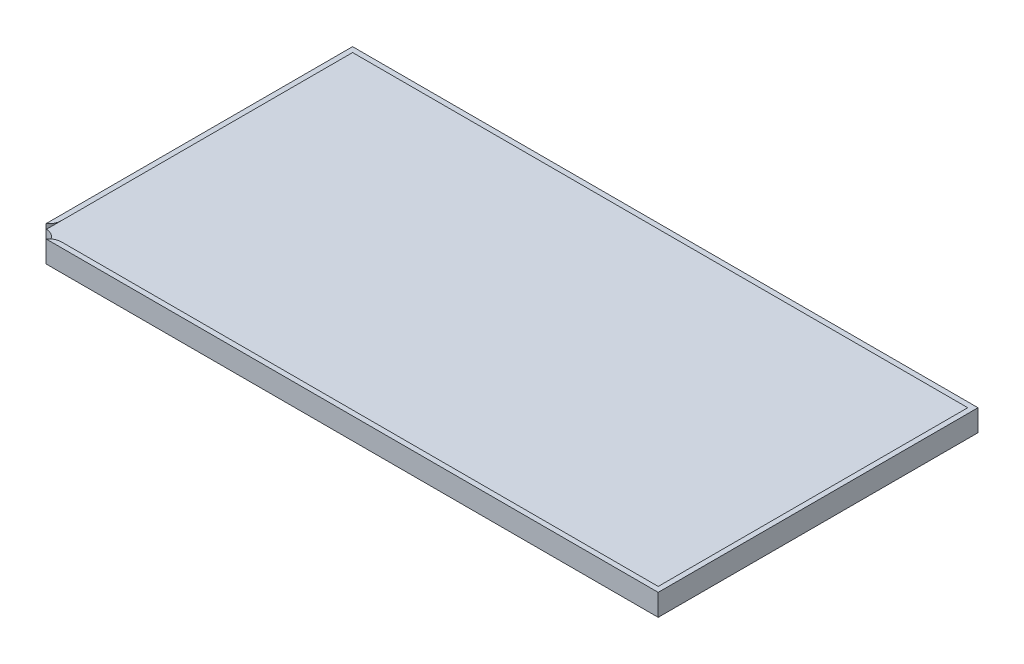
ISO-10303-21;
HEADER;
FILE_DESCRIPTION(('STEP AP214'),'2;1');
FILE_NAME('part.step','',(''),(''),'','','');
FILE_SCHEMA(('AUTOMOTIVE_DESIGN { 1 0 10303 214 1 1 1 1 }'));
ENDSEC;
DATA;
#1=APPLICATION_CONTEXT('core data for automotive mechanical design processes');
#2=APPLICATION_PROTOCOL_DEFINITION('international standard','automotive_design',2000,#1);
#3=PRODUCT_CONTEXT('',#1,'mechanical');
#4=PRODUCT('Part','Part','',(#3));
#5=PRODUCT_RELATED_PRODUCT_CATEGORY('part','',(#4));
#6=PRODUCT_DEFINITION_FORMATION('','',#4);
#7=PRODUCT_DEFINITION_CONTEXT('part definition',#1,'design');
#8=PRODUCT_DEFINITION('design','',#6,#7);
#9=PRODUCT_DEFINITION_SHAPE('','',#8);
#10=(LENGTH_UNIT() NAMED_UNIT(*) SI_UNIT(.MILLI.,.METRE.));
#11=(NAMED_UNIT(*) PLANE_ANGLE_UNIT() SI_UNIT($,.RADIAN.));
#12=(NAMED_UNIT(*) SI_UNIT($,.STERADIAN.) SOLID_ANGLE_UNIT());
#13=UNCERTAINTY_MEASURE_WITH_UNIT(LENGTH_MEASURE(1.E-05),#10,'distance_accuracy_value','');
#14=(GEOMETRIC_REPRESENTATION_CONTEXT(3) GLOBAL_UNCERTAINTY_ASSIGNED_CONTEXT((#13)) GLOBAL_UNIT_ASSIGNED_CONTEXT((#10,
#11,#12)) REPRESENTATION_CONTEXT('',''));
#15=CARTESIAN_POINT('',(0.,0.,0.));
#16=DIRECTION('',(0.,0.,1.));
#17=DIRECTION('',(1.,0.,0.));
#18=AXIS2_PLACEMENT_3D('',#15,#16,#17);
#19=CARTESIAN_POINT('',(0.,27.,0.));
#20=DIRECTION('',(0.,-1.,0.));
#21=DIRECTION('',(0.,0.,-1.));
#22=AXIS2_PLACEMENT_3D('',#19,#20,#21);
#23=PLANE('',#22);
#24=CARTESIAN_POINT('',(-1878.7,27.,799.));
#25=DIRECTION('',(0.,1.,0.));
#26=DIRECTION('',(0.,0.,1.));
#27=AXIS2_PLACEMENT_3D('',#24,#25,#26);
#28=CIRCLE('',#27,76.2);
#29=CARTESIAN_POINT('',(-1832.5,27.,859.597029630171));
#30=VERTEX_POINT('',#29);
#31=CARTESIAN_POINT('',(-1802.5,27.,799.));
#32=VERTEX_POINT('',#31);
#33=EDGE_CURVE('E215',#30,#32,#28,.T.);
#34=ORIENTED_EDGE('',*,*,#33,.T.);
#35=DIRECTION('',(0.,0.,1.));
#36=VECTOR('',#35,1.);
#37=CARTESIAN_POINT('',(-1802.5,27.,0.));
#38=LINE('',#37,#36);
#39=CARTESIAN_POINT('',(-1802.5,27.,-907.));
#40=VERTEX_POINT('',#39);
#41=EDGE_CURVE('E42',#32,#40,#38,.F.);
#42=ORIENTED_EDGE('',*,*,#41,.T.);
#43=DIRECTION('',(-1.,0.,0.));
#44=VECTOR('',#43,1.);
#45=CARTESIAN_POINT('',(0.,27.,-907.));
#46=LINE('',#45,#44);
#47=CARTESIAN_POINT('',(1802.5,27.,-907.000000000001));
#48=VERTEX_POINT('',#47);
#49=EDGE_CURVE('E195',#40,#48,#46,.F.);
#50=ORIENTED_EDGE('',*,*,#49,.T.);
#51=DIRECTION('',(0.,0.,-1.));
#52=VECTOR('',#51,1.);
#53=CARTESIAN_POINT('',(1802.5,27.,0.));
#54=LINE('',#53,#52);
#55=CARTESIAN_POINT('',(1802.5,27.,907.));
#56=VERTEX_POINT('',#55);
#57=EDGE_CURVE('E193',#48,#56,#54,.F.);
#58=ORIENTED_EDGE('',*,*,#57,.T.);
#59=DIRECTION('',(1.,0.,0.));
#60=VECTOR('',#59,1.);
#61=CARTESIAN_POINT('',(0.,27.,907.));
#62=LINE('',#61,#60);
#63=CARTESIAN_POINT('',(-1694.5,27.,907.));
#64=VERTEX_POINT('',#63);
#65=EDGE_CURVE('E11',#56,#64,#62,.F.);
#66=ORIENTED_EDGE('',*,*,#65,.T.);
#67=CARTESIAN_POINT('',(-1694.5,27.,983.2));
#68=DIRECTION('',(0.,1.,0.));
#69=DIRECTION('',(0.,0.,1.));
#70=AXIS2_PLACEMENT_3D('',#67,#68,#69);
#71=CIRCLE('',#70,76.2);
#72=CARTESIAN_POINT('',(-1755.09702963017,27.,937.));
#73=VERTEX_POINT('',#72);
#74=EDGE_CURVE('E147',#64,#73,#71,.T.);
#75=ORIENTED_EDGE('',*,*,#74,.T.);
#76=DIRECTION('',(1.,0.,0.));
#77=VECTOR('',#76,1.);
#78=CARTESIAN_POINT('',(-1832.5,27.,937.));
#79=LINE('',#78,#77);
#80=CARTESIAN_POINT('',(1832.5,27.,937.));
#81=VERTEX_POINT('',#80);
#82=EDGE_CURVE('E143',#73,#81,#79,.T.);
#83=ORIENTED_EDGE('',*,*,#82,.T.);
#84=DIRECTION('',(0.,0.,-1.));
#85=VECTOR('',#84,1.);
#86=CARTESIAN_POINT('',(1832.5,27.,937.));
#87=LINE('',#86,#85);
#88=CARTESIAN_POINT('',(1832.5,27.,-937.));
#89=VERTEX_POINT('',#88);
#90=EDGE_CURVE('E167',#81,#89,#87,.T.);
#91=ORIENTED_EDGE('',*,*,#90,.T.);
#92=DIRECTION('',(-1.,0.,0.));
#93=VECTOR('',#92,1.);
#94=CARTESIAN_POINT('',(-1832.5,27.,-937.));
#95=LINE('',#94,#93);
#96=CARTESIAN_POINT('',(-1832.5,27.,-937.));
#97=VERTEX_POINT('',#96);
#98=EDGE_CURVE('E170',#89,#97,#95,.T.);
#99=ORIENTED_EDGE('',*,*,#98,.T.);
#100=DIRECTION('',(0.,0.,1.));
#101=VECTOR('',#100,1.);
#102=CARTESIAN_POINT('',(-1832.5,27.,937.));
#103=LINE('',#102,#101);
#104=EDGE_CURVE('E172',#97,#30,#103,.T.);
#105=ORIENTED_EDGE('',*,*,#104,.T.);
#106=EDGE_LOOP('',(#34,#42,#50,#58,#66,#75,#83,#91,#99,#105));
#107=FACE_BOUND('',#106,.T.);
#108=ADVANCED_FACE('F33',(#107),#23,.F.);
#109=CARTESIAN_POINT('',(-1832.5,27.,937.));
#110=DIRECTION('',(1.,0.,0.));
#111=DIRECTION('',(0.,0.,-1.));
#112=AXIS2_PLACEMENT_3D('',#109,#110,#111);
#113=PLANE('',#112);
#114=DIRECTION('',(0.,0.,-1.));
#115=VECTOR('',#114,1.);
#116=CARTESIAN_POINT('',(-1832.5,-100.,-937.));
#117=LINE('',#116,#115);
#118=CARTESIAN_POINT('',(-1832.5,-100.,859.597029630172));
#119=VERTEX_POINT('',#118);
#120=CARTESIAN_POINT('',(-1832.5,-100.,-937.));
#121=VERTEX_POINT('',#120);
#122=EDGE_CURVE('E161',#119,#121,#117,.T.);
#123=ORIENTED_EDGE('',*,*,#122,.F.);
#124=DIRECTION('',(0.,1.,0.));
#125=VECTOR('',#124,1.);
#126=CARTESIAN_POINT('',(-1832.5,-100.001,859.597029630172));
#127=LINE('',#126,#125);
#128=CARTESIAN_POINT('',(-1832.5,0.,859.597029630172));
#129=VERTEX_POINT('',#128);
#130=EDGE_CURVE('E50',#129,#119,#127,.F.);
#131=ORIENTED_EDGE('',*,*,#130,.F.);
#132=DIRECTION('',(0.,1.,0.));
#133=VECTOR('',#132,1.);
#134=CARTESIAN_POINT('',(-1832.5,-195.161471607487,859.597029630171));
#135=LINE('',#134,#133);
#136=EDGE_CURVE('E144',#129,#30,#135,.T.);
#137=ORIENTED_EDGE('',*,*,#136,.T.);
#138=ORIENTED_EDGE('',*,*,#104,.F.);
#139=DIRECTION('',(0.,-1.,0.));
#140=VECTOR('',#139,1.);
#141=CARTESIAN_POINT('',(-1832.5,27.,-937.));
#142=LINE('',#141,#140);
#143=EDGE_CURVE('E178',#97,#121,#142,.T.);
#144=ORIENTED_EDGE('',*,*,#143,.T.);
#145=EDGE_LOOP('',(#123,#131,#137,#138,#144));
#146=FACE_BOUND('',#145,.T.);
#147=ADVANCED_FACE('F237',(#146),#113,.F.);
#148=CARTESIAN_POINT('',(-1832.5,27.,937.));
#149=DIRECTION('',(0.,0.,-1.));
#150=DIRECTION('',(-1.,0.,0.));
#151=AXIS2_PLACEMENT_3D('',#148,#149,#150);
#152=PLANE('',#151);
#153=DIRECTION('',(0.,1.,0.));
#154=VECTOR('',#153,1.);
#155=CARTESIAN_POINT('',(-1755.09702963017,-195.161471607487,937.));
#156=LINE('',#155,#154);
#157=CARTESIAN_POINT('',(-1755.09702963017,0.,937.));
#158=VERTEX_POINT('',#157);
#159=EDGE_CURVE('E134',#158,#73,#156,.T.);
#160=ORIENTED_EDGE('',*,*,#159,.F.);
#161=DIRECTION('',(0.,1.,0.));
#162=VECTOR('',#161,1.);
#163=CARTESIAN_POINT('',(-1755.09702963017,-100.001,937.));
#164=LINE('',#163,#162);
#165=CARTESIAN_POINT('',(-1755.09702963017,-100.,937.));
#166=VERTEX_POINT('',#165);
#167=EDGE_CURVE('E117',#166,#158,#164,.T.);
#168=ORIENTED_EDGE('',*,*,#167,.F.);
#169=DIRECTION('',(-1.,0.,0.));
#170=VECTOR('',#169,1.);
#171=CARTESIAN_POINT('',(-1832.5,-100.,937.));
#172=LINE('',#171,#170);
#173=CARTESIAN_POINT('',(1832.5,-100.,937.));
#174=VERTEX_POINT('',#173);
#175=EDGE_CURVE('E159',#174,#166,#172,.T.);
#176=ORIENTED_EDGE('',*,*,#175,.F.);
#177=DIRECTION('',(0.,-1.,0.));
#178=VECTOR('',#177,1.);
#179=CARTESIAN_POINT('',(1832.5,27.,937.));
#180=LINE('',#179,#178);
#181=EDGE_CURVE('E176',#81,#174,#180,.T.);
#182=ORIENTED_EDGE('',*,*,#181,.F.);
#183=ORIENTED_EDGE('',*,*,#82,.F.);
#184=EDGE_LOOP('',(#160,#168,#176,#182,#183));
#185=FACE_BOUND('',#184,.T.);
#186=ADVANCED_FACE('F141',(#185),#152,.F.);
#187=CARTESIAN_POINT('',(-1829.5,0.,0.));
#188=DIRECTION('',(-0.707106781186544,0.707106781186551,0.));
#189=DIRECTION('',(0.,0.,1.));
#190=AXIS2_PLACEMENT_3D('',#187,#188,#189);
#191=PLANE('',#190);
#192=ORIENTED_EDGE('',*,*,#41,.F.);
#193=CARTESIAN_POINT('',(-1878.7,-49.1999999999992,799.));
#194=DIRECTION('',(-0.707106781186544,0.707106781186551,0.));
#195=DIRECTION('',(0.707106781186551,0.707106781186544,0.));
#196=AXIS2_PLACEMENT_3D('',#193,#194,#195);
#197=ELLIPSE('',#196,107.763073452829,76.2);
#198=CARTESIAN_POINT('',(-1829.5,0.,857.18762755088));
#199=VERTEX_POINT('',#198);
#200=EDGE_CURVE('E153',#32,#199,#197,.F.);
#201=ORIENTED_EDGE('',*,*,#200,.T.);
#202=DIRECTION('',(0.,0.,1.));
#203=VECTOR('',#202,1.);
#204=CARTESIAN_POINT('',(-1829.5,0.,0.));
#205=LINE('',#204,#203);
#206=CARTESIAN_POINT('',(-1829.5,0.,-934.000000000001));
#207=VERTEX_POINT('',#206);
#208=EDGE_CURVE('E189',#207,#199,#205,.T.);
#209=ORIENTED_EDGE('',*,*,#208,.F.);
#210=DIRECTION('',(0.577350269189628,0.577350269189621,0.577350269189628));
#211=VECTOR('',#210,1.);
#212=CARTESIAN_POINT('',(-1219.66666666666,609.833333333331,-324.166666666663));
#213=LINE('',#212,#211);
#214=EDGE_CURVE('E37',#207,#40,#213,.T.);
#215=ORIENTED_EDGE('',*,*,#214,.T.);
#216=EDGE_LOOP('',(#192,#201,#209,#215));
#217=FACE_BOUND('',#216,.T.);
#218=ADVANCED_FACE('F209',(#217),#191,.F.);
#219=CARTESIAN_POINT('',(0.,0.,934.000000000001));
#220=DIRECTION('',(0.,0.707106781186551,0.707106781186544));
#221=DIRECTION('',(1.,0.,0.));
#222=AXIS2_PLACEMENT_3D('',#219,#220,#221);
#223=PLANE('',#222);
#224=DIRECTION('',(1.,0.,0.));
#225=VECTOR('',#224,1.);
#226=CARTESIAN_POINT('',(0.,0.,934.000000000001));
#227=LINE('',#226,#225);
#228=CARTESIAN_POINT('',(-1752.68762755088,0.,934.000000000001));
#229=VERTEX_POINT('',#228);
#230=CARTESIAN_POINT('',(1829.5,0.,934.000000000001));
#231=VERTEX_POINT('',#230);
#232=EDGE_CURVE('E191',#229,#231,#227,.T.);
#233=ORIENTED_EDGE('',*,*,#232,.F.);
#234=CARTESIAN_POINT('',(-1694.5,-49.1999999999992,983.2));
#235=DIRECTION('',(0.,0.707106781186551,0.707106781186544));
#236=DIRECTION('',(0.,0.707106781186544,-0.707106781186551));
#237=AXIS2_PLACEMENT_3D('',#234,#235,#236);
#238=ELLIPSE('',#237,107.763073452829,76.2);
#239=EDGE_CURVE('E137',#229,#64,#238,.F.);
#240=ORIENTED_EDGE('',*,*,#239,.T.);
#241=ORIENTED_EDGE('',*,*,#65,.F.);
#242=DIRECTION('',(0.577350269189628,-0.577350269189621,0.577350269189628));
#243=VECTOR('',#242,1.);
#244=CARTESIAN_POINT('',(1518.16666666666,311.333333333332,622.666666666665));
#245=LINE('',#244,#243);
#246=EDGE_CURVE('E166',#56,#231,#245,.T.);
#247=ORIENTED_EDGE('',*,*,#246,.T.);
#248=EDGE_LOOP('',(#233,#240,#241,#247));
#249=FACE_BOUND('',#248,.T.);
#250=ADVANCED_FACE('F222',(#249),#223,.F.);
#251=CARTESIAN_POINT('',(1832.5,27.,937.));
#252=DIRECTION('',(-1.,0.,0.));
#253=DIRECTION('',(0.,0.,1.));
#254=AXIS2_PLACEMENT_3D('',#251,#252,#253);
#255=PLANE('',#254);
#256=ORIENTED_EDGE('',*,*,#181,.T.);
#257=DIRECTION('',(0.,0.,1.));
#258=VECTOR('',#257,1.);
#259=CARTESIAN_POINT('',(1832.5,-100.,-937.));
#260=LINE('',#259,#258);
#261=CARTESIAN_POINT('',(1832.5,-100.,-937.));
#262=VERTEX_POINT('',#261);
#263=EDGE_CURVE('E156',#262,#174,#260,.T.);
#264=ORIENTED_EDGE('',*,*,#263,.F.);
#265=DIRECTION('',(0.,-1.,0.));
#266=VECTOR('',#265,1.);
#267=CARTESIAN_POINT('',(1832.5,27.,-937.));
#268=LINE('',#267,#266);
#269=EDGE_CURVE('E181',#89,#262,#268,.T.);
#270=ORIENTED_EDGE('',*,*,#269,.F.);
#271=ORIENTED_EDGE('',*,*,#90,.F.);
#272=EDGE_LOOP('',(#256,#264,#270,#271));
#273=FACE_BOUND('',#272,.T.);
#274=ADVANCED_FACE('F251',(#273),#255,.F.);
#275=CARTESIAN_POINT('',(-1832.5,27.,-937.));
#276=DIRECTION('',(0.,0.,1.));
#277=DIRECTION('',(1.,0.,0.));
#278=AXIS2_PLACEMENT_3D('',#275,#276,#277);
#279=PLANE('',#278);
#280=ORIENTED_EDGE('',*,*,#269,.T.);
#281=DIRECTION('',(1.,0.,0.));
#282=VECTOR('',#281,1.);
#283=CARTESIAN_POINT('',(-1832.5,-100.,-937.));
#284=LINE('',#283,#282);
#285=EDGE_CURVE('E163',#121,#262,#284,.T.);
#286=ORIENTED_EDGE('',*,*,#285,.F.);
#287=ORIENTED_EDGE('',*,*,#143,.F.);
#288=ORIENTED_EDGE('',*,*,#98,.F.);
#289=EDGE_LOOP('',(#280,#286,#287,#288));
#290=FACE_BOUND('',#289,.T.);
#291=ADVANCED_FACE('F234',(#290),#279,.F.);
#292=CARTESIAN_POINT('',(0.,0.,-934.000000000001));
#293=DIRECTION('',(0.,0.707106781186551,-0.707106781186544));
#294=DIRECTION('',(-1.,0.,0.));
#295=AXIS2_PLACEMENT_3D('',#292,#293,#294);
#296=PLANE('',#295);
#297=DIRECTION('',(-0.577350269189628,0.577350269189621,0.577350269189628));
#298=VECTOR('',#297,1.);
#299=CARTESIAN_POINT('',(1518.16666666666,311.333333333332,-622.666666666665));
#300=LINE('',#299,#298);
#301=CARTESIAN_POINT('',(1829.5,0.,-934.000000000001));
#302=VERTEX_POINT('',#301);
#303=EDGE_CURVE('E199',#48,#302,#300,.F.);
#304=ORIENTED_EDGE('',*,*,#303,.F.);
#305=ORIENTED_EDGE('',*,*,#49,.F.);
#306=ORIENTED_EDGE('',*,*,#214,.F.);
#307=DIRECTION('',(-1.,0.,0.));
#308=VECTOR('',#307,1.);
#309=CARTESIAN_POINT('',(0.,0.,-934.000000000001));
#310=LINE('',#309,#308);
#311=EDGE_CURVE('E186',#302,#207,#310,.T.);
#312=ORIENTED_EDGE('',*,*,#311,.F.);
#313=EDGE_LOOP('',(#304,#305,#306,#312));
#314=FACE_BOUND('',#313,.T.);
#315=ADVANCED_FACE('F35',(#314),#296,.F.);
#316=CARTESIAN_POINT('',(1829.5,0.,0.));
#317=DIRECTION('',(0.707106781186544,0.707106781186551,0.));
#318=DIRECTION('',(0.,0.,-1.));
#319=AXIS2_PLACEMENT_3D('',#316,#317,#318);
#320=PLANE('',#319);
#321=ORIENTED_EDGE('',*,*,#303,.T.);
#322=DIRECTION('',(0.,0.,-1.));
#323=VECTOR('',#322,1.);
#324=CARTESIAN_POINT('',(1829.5,0.,0.));
#325=LINE('',#324,#323);
#326=EDGE_CURVE('E183',#231,#302,#325,.T.);
#327=ORIENTED_EDGE('',*,*,#326,.F.);
#328=ORIENTED_EDGE('',*,*,#246,.F.);
#329=ORIENTED_EDGE('',*,*,#57,.F.);
#330=EDGE_LOOP('',(#321,#327,#328,#329));
#331=FACE_BOUND('',#330,.T.);
#332=ADVANCED_FACE('F224',(#331),#320,.F.);
#333=CARTESIAN_POINT('',(0.,0.,0.));
#334=DIRECTION('',(0.,1.,0.));
#335=DIRECTION('',(0.,0.,1.));
#336=AXIS2_PLACEMENT_3D('',#333,#334,#335);
#337=PLANE('',#336);
#338=CARTESIAN_POINT('',(-1832.5,0.,937.));
#339=DIRECTION('',(0.,1.,0.));
#340=DIRECTION('',(0.,0.,1.));
#341=AXIS2_PLACEMENT_3D('',#338,#339,#340);
#342=CIRCLE('',#341,77.4029703698282);
#343=EDGE_CURVE('E119',#158,#129,#342,.T.);
#344=ORIENTED_EDGE('',*,*,#343,.F.);
#345=CARTESIAN_POINT('',(-1694.5,0.,983.2));
#346=DIRECTION('',(0.,1.,0.));
#347=DIRECTION('',(0.,0.,1.));
#348=AXIS2_PLACEMENT_3D('',#345,#346,#347);
#349=CIRCLE('',#348,76.2);
#350=EDGE_CURVE('E58',#158,#229,#349,.F.);
#351=ORIENTED_EDGE('',*,*,#350,.T.);
#352=ORIENTED_EDGE('',*,*,#232,.T.);
#353=ORIENTED_EDGE('',*,*,#326,.T.);
#354=ORIENTED_EDGE('',*,*,#311,.T.);
#355=ORIENTED_EDGE('',*,*,#208,.T.);
#356=CARTESIAN_POINT('',(-1878.7,0.,799.));
#357=DIRECTION('',(0.,1.,0.));
#358=DIRECTION('',(0.,0.,1.));
#359=AXIS2_PLACEMENT_3D('',#356,#357,#358);
#360=CIRCLE('',#359,76.2);
#361=EDGE_CURVE('E129',#199,#129,#360,.F.);
#362=ORIENTED_EDGE('',*,*,#361,.T.);
#363=EDGE_LOOP('',(#344,#351,#352,#353,#354,#355,#362));
#364=FACE_BOUND('',#363,.T.);
#365=ADVANCED_FACE('F127',(#364),#337,.T.);
#366=CARTESIAN_POINT('',(0.,-100.,0.));
#367=DIRECTION('',(0.,1.,0.));
#368=DIRECTION('',(0.,0.,1.));
#369=AXIS2_PLACEMENT_3D('',#366,#367,#368);
#370=PLANE('',#369);
#371=ORIENTED_EDGE('',*,*,#175,.T.);
#372=CARTESIAN_POINT('',(-1832.5,-100.,937.));
#373=DIRECTION('',(0.,1.,0.));
#374=DIRECTION('',(0.,0.,1.));
#375=AXIS2_PLACEMENT_3D('',#372,#373,#374);
#376=CIRCLE('',#375,77.4029703698282);
#377=EDGE_CURVE('E120',#119,#166,#376,.F.);
#378=ORIENTED_EDGE('',*,*,#377,.F.);
#379=ORIENTED_EDGE('',*,*,#122,.T.);
#380=ORIENTED_EDGE('',*,*,#285,.T.);
#381=ORIENTED_EDGE('',*,*,#263,.T.);
#382=EDGE_LOOP('',(#371,#378,#379,#380,#381));
#383=FACE_BOUND('',#382,.T.);
#384=ADVANCED_FACE('F232',(#383),#370,.F.);
#385=CARTESIAN_POINT('',(-1878.7,-195.161471607487,799.));
#386=DIRECTION('',(0.,1.,0.));
#387=DIRECTION('',(0.,0.,1.));
#388=AXIS2_PLACEMENT_3D('',#385,#386,#387);
#389=CYLINDRICAL_SURFACE('',#388,76.2);
#390=ORIENTED_EDGE('',*,*,#33,.F.);
#391=ORIENTED_EDGE('',*,*,#136,.F.);
#392=ORIENTED_EDGE('',*,*,#361,.F.);
#393=ORIENTED_EDGE('',*,*,#200,.F.);
#394=EDGE_LOOP('',(#390,#391,#392,#393));
#395=FACE_BOUND('',#394,.T.);
#396=ADVANCED_FACE('F301',(#395),#389,.T.);
#397=CARTESIAN_POINT('',(-1694.5,-195.161471607487,983.2));
#398=DIRECTION('',(0.,1.,0.));
#399=DIRECTION('',(0.,0.,1.));
#400=AXIS2_PLACEMENT_3D('',#397,#398,#399);
#401=CYLINDRICAL_SURFACE('',#400,76.2);
#402=ORIENTED_EDGE('',*,*,#350,.F.);
#403=ORIENTED_EDGE('',*,*,#159,.T.);
#404=ORIENTED_EDGE('',*,*,#74,.F.);
#405=ORIENTED_EDGE('',*,*,#239,.F.);
#406=EDGE_LOOP('',(#402,#403,#404,#405));
#407=FACE_BOUND('',#406,.T.);
#408=ADVANCED_FACE('F133',(#407),#401,.T.);
#409=CARTESIAN_POINT('',(-1832.5,-100.001,937.));
#410=DIRECTION('',(0.,1.,0.));
#411=DIRECTION('',(0.,0.,1.));
#412=AXIS2_PLACEMENT_3D('',#409,#410,#411);
#413=CYLINDRICAL_SURFACE('',#412,77.4029703698282);
#414=ORIENTED_EDGE('',*,*,#130,.T.);
#415=ORIENTED_EDGE('',*,*,#377,.T.);
#416=ORIENTED_EDGE('',*,*,#167,.T.);
#417=ORIENTED_EDGE('',*,*,#343,.T.);
#418=EDGE_LOOP('',(#414,#415,#416,#417));
#419=FACE_BOUND('',#418,.T.);
#420=ADVANCED_FACE('F118',(#419),#413,.F.);
#421=CLOSED_SHELL('',(#108,#147,#186,#218,#250,#274,#291,#315,#332,#365,#384,#396,#408,#420));
#422=MANIFOLD_SOLID_BREP('B2',#421);
#423=ADVANCED_BREP_SHAPE_REPRESENTATION('',(#18,#422),#14);
#424=SHAPE_DEFINITION_REPRESENTATION(#9,#423);
ENDSEC;
END-ISO-10303-21;
